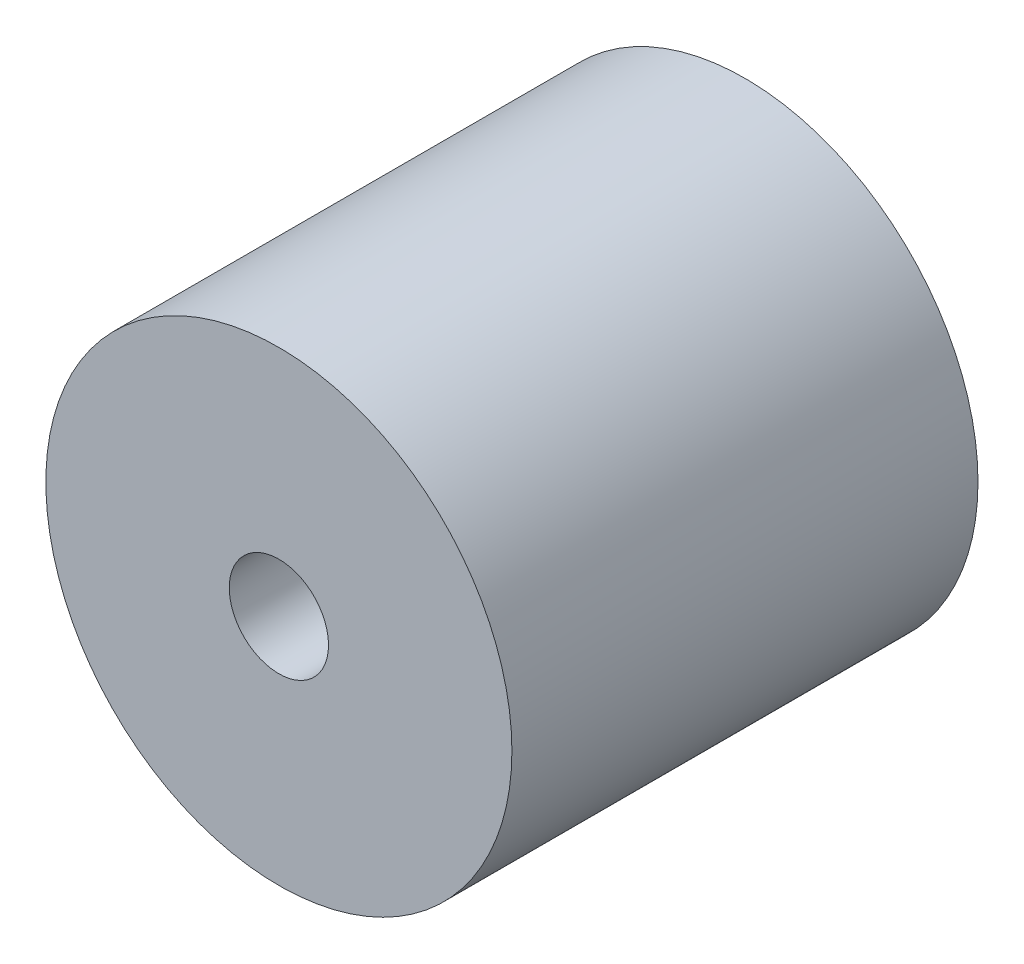
ISO-10303-21;
HEADER;
FILE_DESCRIPTION(('STEP AP214'),'2;1');
FILE_NAME('part.step','',(''),(''),'','','');
FILE_SCHEMA(('AUTOMOTIVE_DESIGN { 1 0 10303 214 1 1 1 1 }'));
ENDSEC;
DATA;
#1=APPLICATION_CONTEXT('core data for automotive mechanical design processes');
#2=APPLICATION_PROTOCOL_DEFINITION('international standard','automotive_design',2000,#1);
#3=PRODUCT_CONTEXT('',#1,'mechanical');
#4=PRODUCT('Part','Part','',(#3));
#5=PRODUCT_RELATED_PRODUCT_CATEGORY('part','',(#4));
#6=PRODUCT_DEFINITION_FORMATION('','',#4);
#7=PRODUCT_DEFINITION_CONTEXT('part definition',#1,'design');
#8=PRODUCT_DEFINITION('design','',#6,#7);
#9=PRODUCT_DEFINITION_SHAPE('','',#8);
#10=(LENGTH_UNIT() NAMED_UNIT(*) SI_UNIT(.MILLI.,.METRE.));
#11=(NAMED_UNIT(*) PLANE_ANGLE_UNIT() SI_UNIT($,.RADIAN.));
#12=(NAMED_UNIT(*) SI_UNIT($,.STERADIAN.) SOLID_ANGLE_UNIT());
#13=UNCERTAINTY_MEASURE_WITH_UNIT(LENGTH_MEASURE(1.E-05),#10,'distance_accuracy_value','');
#14=(GEOMETRIC_REPRESENTATION_CONTEXT(3) GLOBAL_UNCERTAINTY_ASSIGNED_CONTEXT((#13)) GLOBAL_UNIT_ASSIGNED_CONTEXT((#10,
#11,#12)) REPRESENTATION_CONTEXT('',''));
#15=CARTESIAN_POINT('',(0.,0.,0.));
#16=DIRECTION('',(0.,0.,1.));
#17=DIRECTION('',(1.,0.,0.));
#18=AXIS2_PLACEMENT_3D('',#15,#16,#17);
#19=CARTESIAN_POINT('',(0.,0.,25.4));
#20=DIRECTION('',(0.,0.,-1.));
#21=DIRECTION('',(-1.,0.,0.));
#22=AXIS2_PLACEMENT_3D('',#19,#20,#21);
#23=CYLINDRICAL_SURFACE('',#22,12.7);
#24=CARTESIAN_POINT('',(0.,0.,25.4));
#25=DIRECTION('',(0.,0.,1.));
#26=DIRECTION('',(1.,0.,0.));
#27=AXIS2_PLACEMENT_3D('',#24,#25,#26);
#28=CIRCLE('',#27,12.7);
#29=CARTESIAN_POINT('',(12.7,0.,25.4));
#30=VERTEX_POINT('',#29);
#31=EDGE_CURVE('E10',#30,#30,#28,.T.);
#32=ORIENTED_EDGE('',*,*,#31,.F.);
#33=EDGE_LOOP('',(#32));
#34=FACE_BOUND('',#33,.T.);
#35=CARTESIAN_POINT('',(0.,0.,0.));
#36=DIRECTION('',(0.,0.,1.));
#37=DIRECTION('',(1.,0.,0.));
#38=AXIS2_PLACEMENT_3D('',#35,#36,#37);
#39=CIRCLE('',#38,12.7);
#40=CARTESIAN_POINT('',(12.7,0.,0.));
#41=VERTEX_POINT('',#40);
#42=EDGE_CURVE('E39',#41,#41,#39,.T.);
#43=ORIENTED_EDGE('',*,*,#42,.T.);
#44=EDGE_LOOP('',(#43));
#45=FACE_BOUND('',#44,.T.);
#46=ADVANCED_FACE('F32',(#34,#45),#23,.T.);
#47=CARTESIAN_POINT('',(0.,0.,25.4));
#48=DIRECTION('',(0.,0.,1.));
#49=DIRECTION('',(1.,0.,0.));
#50=AXIS2_PLACEMENT_3D('',#47,#48,#49);
#51=PLANE('',#50);
#52=CARTESIAN_POINT('',(0.,0.,25.4));
#53=DIRECTION('',(0.,0.,1.));
#54=DIRECTION('',(1.,0.,0.));
#55=AXIS2_PLACEMENT_3D('',#52,#53,#54);
#56=CIRCLE('',#55,2.70509999999999);
#57=CARTESIAN_POINT('',(2.70509999999999,0.,25.4));
#58=VERTEX_POINT('',#57);
#59=EDGE_CURVE('E67',#58,#58,#56,.T.);
#60=ORIENTED_EDGE('',*,*,#59,.F.);
#61=EDGE_LOOP('',(#60));
#62=FACE_BOUND('',#61,.T.);
#63=ORIENTED_EDGE('',*,*,#31,.T.);
#64=EDGE_LOOP('',(#63));
#65=FACE_BOUND('',#64,.T.);
#66=ADVANCED_FACE('F92',(#62,#65),#51,.T.);
#67=CARTESIAN_POINT('',(0.,0.,0.));
#68=DIRECTION('',(0.,0.,1.));
#69=DIRECTION('',(1.,0.,0.));
#70=AXIS2_PLACEMENT_3D('',#67,#68,#69);
#71=PLANE('',#70);
#72=CARTESIAN_POINT('',(0.,0.,0.));
#73=DIRECTION('',(0.,0.,-1.));
#74=DIRECTION('',(-1.,0.,0.));
#75=AXIS2_PLACEMENT_3D('',#72,#73,#74);
#76=CIRCLE('',#75,10.4);
#77=CARTESIAN_POINT('',(-10.4,0.,0.));
#78=VERTEX_POINT('',#77);
#79=EDGE_CURVE('E47',#78,#78,#76,.T.);
#80=ORIENTED_EDGE('',*,*,#79,.F.);
#81=EDGE_LOOP('',(#80));
#82=FACE_BOUND('',#81,.T.);
#83=ORIENTED_EDGE('',*,*,#42,.F.);
#84=EDGE_LOOP('',(#83));
#85=FACE_BOUND('',#84,.T.);
#86=ADVANCED_FACE('F97',(#82,#85),#71,.F.);
#87=CARTESIAN_POINT('',(0.,0.,5.5));
#88=DIRECTION('',(0.,0.,-1.));
#89=DIRECTION('',(-1.,0.,0.));
#90=AXIS2_PLACEMENT_3D('',#87,#88,#89);
#91=CYLINDRICAL_SURFACE('',#90,10.4);
#92=CARTESIAN_POINT('',(0.,0.,1.));
#93=DIRECTION('',(0.,0.,-1.));
#94=DIRECTION('',(-1.,0.,0.));
#95=AXIS2_PLACEMENT_3D('',#92,#93,#94);
#96=CIRCLE('',#95,10.4);
#97=CARTESIAN_POINT('',(-10.4,0.,1.));
#98=VERTEX_POINT('',#97);
#99=EDGE_CURVE('E50',#98,#98,#96,.F.);
#100=ORIENTED_EDGE('',*,*,#99,.T.);
#101=EDGE_LOOP('',(#100));
#102=FACE_BOUND('',#101,.T.);
#103=ORIENTED_EDGE('',*,*,#79,.T.);
#104=EDGE_LOOP('',(#103));
#105=FACE_BOUND('',#104,.T.);
#106=ADVANCED_FACE('F104',(#102,#105),#91,.F.);
#107=CARTESIAN_POINT('',(0.,0.,2.8));
#108=DIRECTION('',(0.,0.,-1.));
#109=DIRECTION('',(-1.,0.,0.));
#110=AXIS2_PLACEMENT_3D('',#107,#108,#109);
#111=PLANE('',#110);
#112=CARTESIAN_POINT('',(0.,0.,2.8));
#113=DIRECTION('',(0.,0.,-1.));
#114=DIRECTION('',(-1.,0.,0.));
#115=AXIS2_PLACEMENT_3D('',#112,#113,#114);
#116=CIRCLE('',#115,11.75);
#117=CARTESIAN_POINT('',(-11.75,0.,2.8));
#118=VERTEX_POINT('',#117);
#119=EDGE_CURVE('E53',#118,#118,#116,.T.);
#120=ORIENTED_EDGE('',*,*,#119,.T.);
#121=EDGE_LOOP('',(#120));
#122=FACE_BOUND('',#121,.T.);
#123=CARTESIAN_POINT('',(0.,0.,2.8));
#124=DIRECTION('',(0.,0.,-1.));
#125=DIRECTION('',(-1.,0.,0.));
#126=AXIS2_PLACEMENT_3D('',#123,#124,#125);
#127=CIRCLE('',#126,10.4);
#128=CARTESIAN_POINT('',(-10.4,0.,2.8));
#129=VERTEX_POINT('',#128);
#130=EDGE_CURVE('E52',#129,#129,#127,.F.);
#131=ORIENTED_EDGE('',*,*,#130,.T.);
#132=EDGE_LOOP('',(#131));
#133=FACE_BOUND('',#132,.T.);
#134=ADVANCED_FACE('F109',(#122,#133),#111,.T.);
#135=CARTESIAN_POINT('',(0.,0.,1.));
#136=DIRECTION('',(0.,0.,-1.));
#137=DIRECTION('',(-1.,0.,0.));
#138=AXIS2_PLACEMENT_3D('',#135,#136,#137);
#139=PLANE('',#138);
#140=CARTESIAN_POINT('',(0.,0.,1.));
#141=DIRECTION('',(0.,0.,-1.));
#142=DIRECTION('',(-1.,0.,0.));
#143=AXIS2_PLACEMENT_3D('',#140,#141,#142);
#144=CIRCLE('',#143,11.75);
#145=CARTESIAN_POINT('',(-11.75,0.,1.));
#146=VERTEX_POINT('',#145);
#147=EDGE_CURVE('E64',#146,#146,#144,.T.);
#148=ORIENTED_EDGE('',*,*,#147,.F.);
#149=EDGE_LOOP('',(#148));
#150=FACE_BOUND('',#149,.T.);
#151=ORIENTED_EDGE('',*,*,#99,.F.);
#152=EDGE_LOOP('',(#151));
#153=FACE_BOUND('',#152,.T.);
#154=ADVANCED_FACE('F119',(#150,#153),#139,.F.);
#155=CARTESIAN_POINT('',(0.,0.,2.8));
#156=DIRECTION('',(0.,0.,-1.));
#157=DIRECTION('',(-1.,0.,0.));
#158=AXIS2_PLACEMENT_3D('',#155,#156,#157);
#159=CYLINDRICAL_SURFACE('',#158,11.75);
#160=ORIENTED_EDGE('',*,*,#119,.F.);
#161=EDGE_LOOP('',(#160));
#162=FACE_BOUND('',#161,.T.);
#163=ORIENTED_EDGE('',*,*,#147,.T.);
#164=EDGE_LOOP('',(#163));
#165=FACE_BOUND('',#164,.T.);
#166=ADVANCED_FACE('F116',(#162,#165),#159,.F.);
#167=CARTESIAN_POINT('',(0.,0.,5.5));
#168=DIRECTION('',(0.,0.,-1.));
#169=DIRECTION('',(-1.,0.,0.));
#170=AXIS2_PLACEMENT_3D('',#167,#168,#169);
#171=PLANE('',#170);
#172=CARTESIAN_POINT('',(0.,0.,5.5));
#173=DIRECTION('',(0.,0.,1.));
#174=DIRECTION('',(1.,0.,0.));
#175=AXIS2_PLACEMENT_3D('',#172,#173,#174);
#176=CIRCLE('',#175,8.65462422223118);
#177=CARTESIAN_POINT('',(8.65462422223118,0.,5.5));
#178=VERTEX_POINT('',#177);
#179=EDGE_CURVE('E72',#178,#178,#176,.T.);
#180=ORIENTED_EDGE('',*,*,#179,.T.);
#181=EDGE_LOOP('',(#180));
#182=FACE_BOUND('',#181,.T.);
#183=CARTESIAN_POINT('',(0.,0.,5.5));
#184=DIRECTION('',(0.,0.,-1.));
#185=DIRECTION('',(-1.,0.,0.));
#186=AXIS2_PLACEMENT_3D('',#183,#184,#185);
#187=CIRCLE('',#186,10.4);
#188=CARTESIAN_POINT('',(-10.4,0.,5.5));
#189=VERTEX_POINT('',#188);
#190=EDGE_CURVE('E44',#189,#189,#187,.T.);
#191=ORIENTED_EDGE('',*,*,#190,.T.);
#192=EDGE_LOOP('',(#191));
#193=FACE_BOUND('',#192,.T.);
#194=ADVANCED_FACE('F113',(#182,#193),#171,.T.);
#195=ORIENTED_EDGE('',*,*,#190,.F.);
#196=EDGE_LOOP('',(#195));
#197=FACE_BOUND('',#196,.T.);
#198=ORIENTED_EDGE('',*,*,#130,.F.);
#199=EDGE_LOOP('',(#198));
#200=FACE_BOUND('',#199,.T.);
#201=ADVANCED_FACE('F89',(#197,#200),#91,.F.);
#202=CARTESIAN_POINT('',(0.,0.,25.4));
#203=DIRECTION('',(0.,0.,1.));
#204=DIRECTION('',(1.,0.,0.));
#205=AXIS2_PLACEMENT_3D('',#202,#203,#204);
#206=CYLINDRICAL_SURFACE('',#205,2.70509999999999);
#207=CARTESIAN_POINT('',(0.,0.,19.1815824070187));
#208=DIRECTION('',(0.,0.,-1.));
#209=DIRECTION('',(-1.,0.,0.));
#210=AXIS2_PLACEMENT_3D('',#207,#208,#209);
#211=CIRCLE('',#210,2.70509999999999);
#212=CARTESIAN_POINT('',(-2.70509999999999,0.,19.1815824070187));
#213=VERTEX_POINT('',#212);
#214=EDGE_CURVE('E35',#213,#213,#211,.T.);
#215=ORIENTED_EDGE('',*,*,#214,.T.);
#216=EDGE_LOOP('',(#215));
#217=FACE_BOUND('',#216,.T.);
#218=ORIENTED_EDGE('',*,*,#59,.T.);
#219=EDGE_LOOP('',(#218));
#220=FACE_BOUND('',#219,.T.);
#221=ADVANCED_FACE('F79',(#217,#220),#206,.F.);
#222=CARTESIAN_POINT('',(0.,0.,25.402256058692));
#223=DIRECTION('',(0.,0.,-1.));
#224=DIRECTION('',(-1.,0.,0.));
#225=AXIS2_PLACEMENT_3D('',#222,#223,#224);
#226=CONICAL_SURFACE('',#225,0.,0.410189432476761);
#227=ORIENTED_EDGE('',*,*,#179,.F.);
#228=EDGE_LOOP('',(#227));
#229=FACE_BOUND('',#228,.T.);
#230=ORIENTED_EDGE('',*,*,#214,.F.);
#231=EDGE_LOOP('',(#230));
#232=FACE_BOUND('',#231,.T.);
#233=ADVANCED_FACE('F82',(#229,#232),#226,.F.);
#234=CLOSED_SHELL('',(#46,#66,#86,#106,#134,#154,#166,#194,#201,#221,#233));
#235=MANIFOLD_SOLID_BREP('B2',#234);
#236=ADVANCED_BREP_SHAPE_REPRESENTATION('',(#18,#235),#14);
#237=SHAPE_DEFINITION_REPRESENTATION(#9,#236);
ENDSEC;
END-ISO-10303-21;
